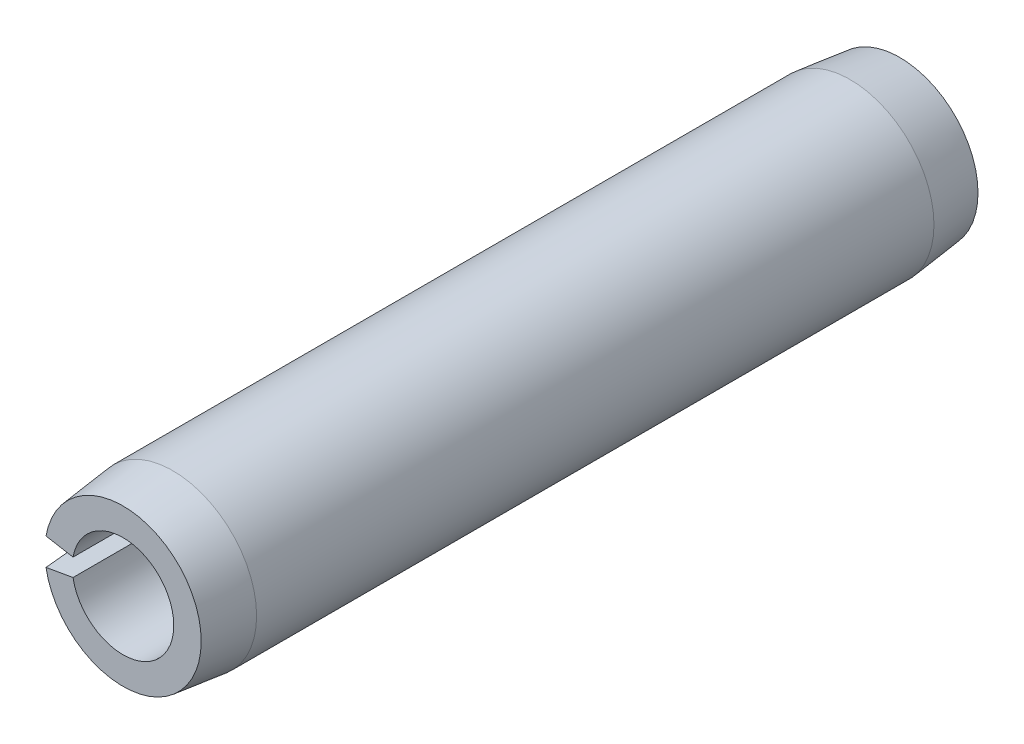
ISO-10303-21;
HEADER;
FILE_DESCRIPTION(('STEP AP214'),'2;1');
FILE_NAME('part.step','',(''),(''),'','','');
FILE_SCHEMA(('AUTOMOTIVE_DESIGN { 1 0 10303 214 1 1 1 1 }'));
ENDSEC;
DATA;
#1=APPLICATION_CONTEXT('core data for automotive mechanical design processes');
#2=APPLICATION_PROTOCOL_DEFINITION('international standard','automotive_design',2000,#1);
#3=PRODUCT_CONTEXT('',#1,'mechanical');
#4=PRODUCT('Part','Part','',(#3));
#5=PRODUCT_RELATED_PRODUCT_CATEGORY('part','',(#4));
#6=PRODUCT_DEFINITION_FORMATION('','',#4);
#7=PRODUCT_DEFINITION_CONTEXT('part definition',#1,'design');
#8=PRODUCT_DEFINITION('design','',#6,#7);
#9=PRODUCT_DEFINITION_SHAPE('','',#8);
#10=(LENGTH_UNIT() NAMED_UNIT(*) SI_UNIT(.MILLI.,.METRE.));
#11=(NAMED_UNIT(*) PLANE_ANGLE_UNIT() SI_UNIT($,.RADIAN.));
#12=(NAMED_UNIT(*) SI_UNIT($,.STERADIAN.) SOLID_ANGLE_UNIT());
#13=UNCERTAINTY_MEASURE_WITH_UNIT(LENGTH_MEASURE(1.E-05),#10,'distance_accuracy_value','');
#14=(GEOMETRIC_REPRESENTATION_CONTEXT(3) GLOBAL_UNCERTAINTY_ASSIGNED_CONTEXT((#13)) GLOBAL_UNIT_ASSIGNED_CONTEXT((#10,
#11,#12)) REPRESENTATION_CONTEXT('',''));
#15=CARTESIAN_POINT('',(0.,0.,0.));
#16=DIRECTION('',(0.,0.,1.));
#17=DIRECTION('',(1.,0.,0.));
#18=AXIS2_PLACEMENT_3D('',#15,#16,#17);
#19=CARTESIAN_POINT('',(0.,0.,9.525));
#20=DIRECTION('',(0.,0.,-1.));
#21=DIRECTION('',(-1.,0.,0.));
#22=AXIS2_PLACEMENT_3D('',#19,#20,#21);
#23=CYLINDRICAL_SURFACE('',#22,1.2446);
#24=CARTESIAN_POINT('',(0.,0.,-9.525));
#25=DIRECTION('',(0.,0.,-1.));
#26=DIRECTION('',(1.,0.,0.));
#27=AXIS2_PLACEMENT_3D('',#24,#25,#26);
#28=CIRCLE('',#27,1.2446);
#29=CARTESIAN_POINT('',(-1.22569172939899,0.216122521924258,-9.525));
#30=VERTEX_POINT('',#29);
#31=CARTESIAN_POINT('',(-1.22569172939899,-0.216122521924258,-9.525));
#32=VERTEX_POINT('',#31);
#33=EDGE_CURVE('E117',#30,#32,#28,.T.);
#34=ORIENTED_EDGE('',*,*,#33,.T.);
#35=DIRECTION('',(0.,0.,-1.));
#36=VECTOR('',#35,1.);
#37=CARTESIAN_POINT('',(-1.22569172939899,-0.216122521924258,9.525));
#38=LINE('',#37,#36);
#39=CARTESIAN_POINT('',(-1.22569172939899,-0.216122521924258,9.525));
#40=VERTEX_POINT('',#39);
#41=EDGE_CURVE('E11',#40,#32,#38,.T.);
#42=ORIENTED_EDGE('',*,*,#41,.F.);
#43=CARTESIAN_POINT('',(0.,0.,9.525));
#44=DIRECTION('',(0.,0.,-1.));
#45=DIRECTION('',(1.,0.,0.));
#46=AXIS2_PLACEMENT_3D('',#43,#44,#45);
#47=CIRCLE('',#46,1.2446);
#48=CARTESIAN_POINT('',(-1.22569172939899,0.216122521924258,9.525));
#49=VERTEX_POINT('',#48);
#50=EDGE_CURVE('E113',#49,#40,#47,.T.);
#51=ORIENTED_EDGE('',*,*,#50,.F.);
#52=DIRECTION('',(0.,0.,-1.));
#53=VECTOR('',#52,1.);
#54=CARTESIAN_POINT('',(-1.22569172939899,0.216122521924258,9.525));
#55=LINE('',#54,#53);
#56=EDGE_CURVE('E106',#49,#30,#55,.T.);
#57=ORIENTED_EDGE('',*,*,#56,.T.);
#58=EDGE_LOOP('',(#34,#42,#51,#57));
#59=FACE_BOUND('',#58,.T.);
#60=ADVANCED_FACE('F34',(#59),#23,.F.);
#61=CARTESIAN_POINT('',(-1.22569172939899,-0.216122521924258,9.525));
#62=DIRECTION('',(0.173648177666927,-0.984807753012209,0.));
#63=DIRECTION('',(0.984807753012209,0.173648177666927,0.));
#64=AXIS2_PLACEMENT_3D('',#61,#62,#63);
#65=PLANE('',#64);
#66=DIRECTION('',(0.,0.,-1.));
#67=VECTOR('',#66,1.);
#68=CARTESIAN_POINT('',(-2.02614347104732,-0.357263760731936,9.525));
#69=LINE('',#68,#67);
#70=CARTESIAN_POINT('',(-2.02614347104732,-0.357263760731937,8.3058));
#71=VERTEX_POINT('',#70);
#72=CARTESIAN_POINT('',(-2.02614347104732,-0.357263760731937,-8.3058));
#73=VERTEX_POINT('',#72);
#74=EDGE_CURVE('E41',#71,#73,#69,.T.);
#75=ORIENTED_EDGE('',*,*,#74,.F.);
#76=DIRECTION('',(-0.112108996385355,-0.0197678408428855,-0.993499272973));
#77=VECTOR('',#76,1.);
#78=CARTESIAN_POINT('',(0.,0.,26.2612909090906));
#79=LINE('',#78,#77);
#80=CARTESIAN_POINT('',(-1.88856582795152,-0.333005110311867,9.525));
#81=VERTEX_POINT('',#80);
#82=EDGE_CURVE('E88',#71,#81,#79,.F.);
#83=ORIENTED_EDGE('',*,*,#82,.T.);
#84=DIRECTION('',(-0.984807753012208,-0.173648177666927,0.));
#85=VECTOR('',#84,1.);
#86=CARTESIAN_POINT('',(-1.22569172939899,-0.216122521924258,9.525));
#87=LINE('',#86,#85);
#88=EDGE_CURVE('E121',#40,#81,#87,.T.);
#89=ORIENTED_EDGE('',*,*,#88,.F.);
#90=ORIENTED_EDGE('',*,*,#41,.T.);
#91=DIRECTION('',(-0.984807753012208,-0.173648177666927,0.));
#92=VECTOR('',#91,1.);
#93=CARTESIAN_POINT('',(-1.22569172939899,-0.216122521924258,-9.525));
#94=LINE('',#93,#92);
#95=CARTESIAN_POINT('',(-1.88856582795152,-0.333005110311867,-9.525));
#96=VERTEX_POINT('',#95);
#97=EDGE_CURVE('E114',#32,#96,#94,.T.);
#98=ORIENTED_EDGE('',*,*,#97,.T.);
#99=DIRECTION('',(0.112108996385355,0.0197678408428855,-0.993499272973));
#100=VECTOR('',#99,1.);
#101=CARTESIAN_POINT('',(0.,0.,-26.2612909090906));
#102=LINE('',#101,#100);
#103=EDGE_CURVE('E56',#96,#73,#102,.F.);
#104=ORIENTED_EDGE('',*,*,#103,.T.);
#105=EDGE_LOOP('',(#75,#83,#89,#90,#98,#104));
#106=FACE_BOUND('',#105,.T.);
#107=ADVANCED_FACE('F135',(#106),#65,.F.);
#108=CARTESIAN_POINT('',(0.,0.,9.525));
#109=DIRECTION('',(0.,0.,-1.));
#110=DIRECTION('',(-1.,0.,0.));
#111=AXIS2_PLACEMENT_3D('',#108,#109,#110);
#112=CYLINDRICAL_SURFACE('',#111,2.0574);
#113=DIRECTION('',(0.,0.,-1.));
#114=VECTOR('',#113,1.);
#115=CARTESIAN_POINT('',(-2.02614347104732,0.357263760731936,9.525));
#116=LINE('',#115,#114);
#117=CARTESIAN_POINT('',(-2.02614347104732,0.357263760731937,8.3058));
#118=VERTEX_POINT('',#117);
#119=CARTESIAN_POINT('',(-2.02614347104732,0.357263760731937,-8.3058));
#120=VERTEX_POINT('',#119);
#121=EDGE_CURVE('E98',#118,#120,#116,.T.);
#122=ORIENTED_EDGE('',*,*,#121,.F.);
#123=CARTESIAN_POINT('',(0.,0.,8.3058));
#124=DIRECTION('',(0.,0.,-1.));
#125=DIRECTION('',(-1.,0.,0.));
#126=AXIS2_PLACEMENT_3D('',#123,#124,#125);
#127=CIRCLE('',#126,2.05740000000001);
#128=EDGE_CURVE('E85',#118,#71,#127,.T.);
#129=ORIENTED_EDGE('',*,*,#128,.T.);
#130=ORIENTED_EDGE('',*,*,#74,.T.);
#131=CARTESIAN_POINT('',(0.,0.,-8.3058));
#132=DIRECTION('',(0.,0.,-1.));
#133=DIRECTION('',(-1.,0.,0.));
#134=AXIS2_PLACEMENT_3D('',#131,#132,#133);
#135=CIRCLE('',#134,2.05740000000001);
#136=EDGE_CURVE('E105',#120,#73,#135,.T.);
#137=ORIENTED_EDGE('',*,*,#136,.F.);
#138=EDGE_LOOP('',(#122,#129,#130,#137));
#139=FACE_BOUND('',#138,.T.);
#140=ADVANCED_FACE('F104',(#139),#112,.T.);
#141=CARTESIAN_POINT('',(-2.02614347104732,0.357263760731936,9.525));
#142=DIRECTION('',(0.173648177666927,0.984807753012209,0.));
#143=DIRECTION('',(-0.984807753012209,0.173648177666927,0.));
#144=AXIS2_PLACEMENT_3D('',#141,#142,#143);
#145=PLANE('',#144);
#146=DIRECTION('',(0.984807753012208,-0.173648177666927,0.));
#147=VECTOR('',#146,1.);
#148=CARTESIAN_POINT('',(-2.02614347104732,0.357263760731936,9.525));
#149=LINE('',#148,#147);
#150=CARTESIAN_POINT('',(-1.88856582795151,0.333005110311867,9.525));
#151=VERTEX_POINT('',#150);
#152=EDGE_CURVE('E101',#151,#49,#149,.T.);
#153=ORIENTED_EDGE('',*,*,#152,.F.);
#154=DIRECTION('',(0.112108996385355,-0.0197678408428855,0.993499272973));
#155=VECTOR('',#154,1.);
#156=CARTESIAN_POINT('',(0.,0.,26.2612909090906));
#157=LINE('',#156,#155);
#158=EDGE_CURVE('E48',#151,#118,#157,.F.);
#159=ORIENTED_EDGE('',*,*,#158,.T.);
#160=ORIENTED_EDGE('',*,*,#121,.T.);
#161=DIRECTION('',(-0.112108996385355,0.0197678408428855,0.993499272973));
#162=VECTOR('',#161,1.);
#163=CARTESIAN_POINT('',(0.,0.,-26.2612909090906));
#164=LINE('',#163,#162);
#165=CARTESIAN_POINT('',(-1.88856582795151,0.333005110311867,-9.525));
#166=VERTEX_POINT('',#165);
#167=EDGE_CURVE('E127',#120,#166,#164,.F.);
#168=ORIENTED_EDGE('',*,*,#167,.T.);
#169=DIRECTION('',(0.984807753012208,-0.173648177666927,0.));
#170=VECTOR('',#169,1.);
#171=CARTESIAN_POINT('',(-2.02614347104732,0.357263760731936,-9.525));
#172=LINE('',#171,#170);
#173=EDGE_CURVE('E111',#166,#30,#172,.T.);
#174=ORIENTED_EDGE('',*,*,#173,.T.);
#175=ORIENTED_EDGE('',*,*,#56,.F.);
#176=EDGE_LOOP('',(#153,#159,#160,#168,#174,#175));
#177=FACE_BOUND('',#176,.T.);
#178=ADVANCED_FACE('F96',(#177),#145,.F.);
#179=CARTESIAN_POINT('',(0.,0.,9.525));
#180=DIRECTION('',(0.,0.,1.));
#181=DIRECTION('',(1.,0.,0.));
#182=AXIS2_PLACEMENT_3D('',#179,#180,#181);
#183=PLANE('',#182);
#184=CARTESIAN_POINT('',(0.,0.,9.525));
#185=DIRECTION('',(0.,0.,-1.));
#186=DIRECTION('',(-1.,0.,0.));
#187=AXIS2_PLACEMENT_3D('',#184,#185,#186);
#188=CIRCLE('',#187,1.9177);
#189=EDGE_CURVE('E92',#151,#81,#188,.T.);
#190=ORIENTED_EDGE('',*,*,#189,.F.);
#191=ORIENTED_EDGE('',*,*,#152,.T.);
#192=ORIENTED_EDGE('',*,*,#50,.T.);
#193=ORIENTED_EDGE('',*,*,#88,.T.);
#194=EDGE_LOOP('',(#190,#191,#192,#193));
#195=FACE_BOUND('',#194,.T.);
#196=ADVANCED_FACE('F136',(#195),#183,.T.);
#197=CARTESIAN_POINT('',(0.,0.,-9.525));
#198=DIRECTION('',(0.,0.,1.));
#199=DIRECTION('',(1.,0.,0.));
#200=AXIS2_PLACEMENT_3D('',#197,#198,#199);
#201=PLANE('',#200);
#202=ORIENTED_EDGE('',*,*,#173,.F.);
#203=CARTESIAN_POINT('',(0.,0.,-9.525));
#204=DIRECTION('',(0.,0.,-1.));
#205=DIRECTION('',(-1.,0.,0.));
#206=AXIS2_PLACEMENT_3D('',#203,#204,#205);
#207=CIRCLE('',#206,1.9177);
#208=EDGE_CURVE('E129',#166,#96,#207,.T.);
#209=ORIENTED_EDGE('',*,*,#208,.T.);
#210=ORIENTED_EDGE('',*,*,#97,.F.);
#211=ORIENTED_EDGE('',*,*,#33,.F.);
#212=EDGE_LOOP('',(#202,#209,#210,#211));
#213=FACE_BOUND('',#212,.T.);
#214=ADVANCED_FACE('F143',(#213),#201,.F.);
#215=CARTESIAN_POINT('',(0.,0.,-8.3058));
#216=DIRECTION('',(0.,0.,1.));
#217=DIRECTION('',(1.,0.,0.));
#218=AXIS2_PLACEMENT_3D('',#215,#216,#217);
#219=CONICAL_SURFACE('',#218,2.05740000000001,0.114085779168162);
#220=ORIENTED_EDGE('',*,*,#208,.F.);
#221=ORIENTED_EDGE('',*,*,#167,.F.);
#222=ORIENTED_EDGE('',*,*,#136,.T.);
#223=ORIENTED_EDGE('',*,*,#103,.F.);
#224=EDGE_LOOP('',(#220,#221,#222,#223));
#225=FACE_BOUND('',#224,.T.);
#226=ADVANCED_FACE('F144',(#225),#219,.T.);
#227=CARTESIAN_POINT('',(0.,0.,9.525));
#228=DIRECTION('',(0.,0.,-1.));
#229=DIRECTION('',(-1.,0.,0.));
#230=AXIS2_PLACEMENT_3D('',#227,#228,#229);
#231=CONICAL_SURFACE('',#230,1.9177,0.114085779168162);
#232=ORIENTED_EDGE('',*,*,#128,.F.);
#233=ORIENTED_EDGE('',*,*,#158,.F.);
#234=ORIENTED_EDGE('',*,*,#189,.T.);
#235=ORIENTED_EDGE('',*,*,#82,.F.);
#236=EDGE_LOOP('',(#232,#233,#234,#235));
#237=FACE_BOUND('',#236,.T.);
#238=ADVANCED_FACE('F86',(#237),#231,.T.);
#239=CLOSED_SHELL('',(#60,#107,#140,#178,#196,#214,#226,#238));
#240=MANIFOLD_SOLID_BREP('B2',#239);
#241=ADVANCED_BREP_SHAPE_REPRESENTATION('',(#18,#240),#14);
#242=SHAPE_DEFINITION_REPRESENTATION(#9,#241);
ENDSEC;
END-ISO-10303-21;
